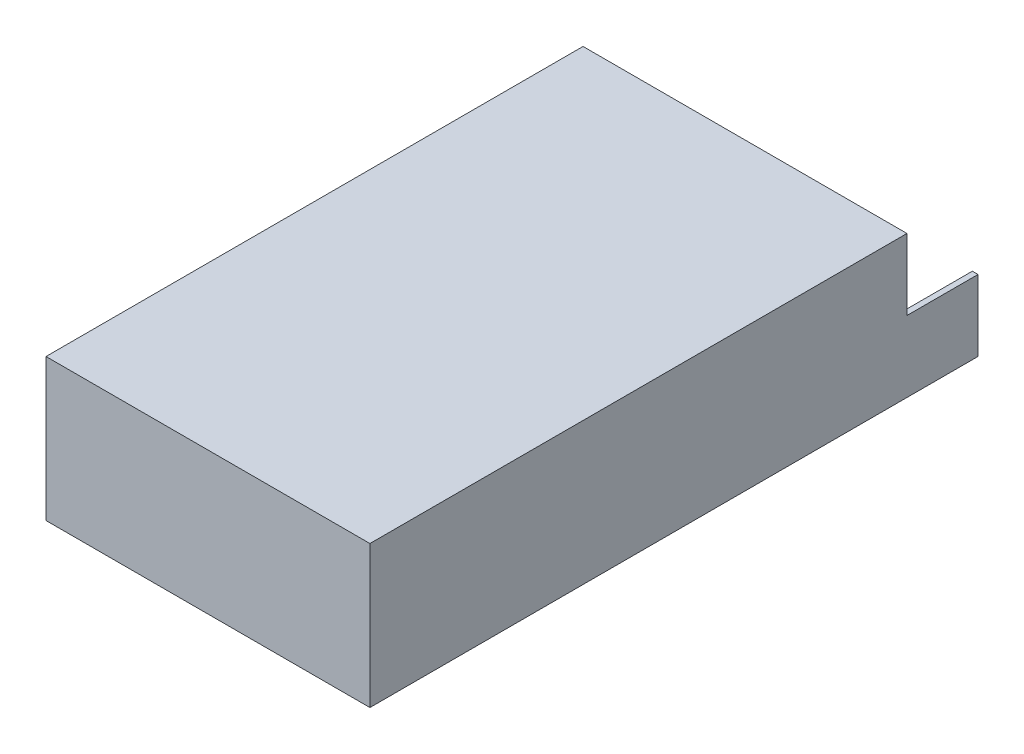
ISO-10303-21;
HEADER;
FILE_DESCRIPTION(('STEP AP214'),'2;1');
FILE_NAME('part.step','',(''),(''),'','','');
FILE_SCHEMA(('AUTOMOTIVE_DESIGN { 1 0 10303 214 1 1 1 1 }'));
ENDSEC;
DATA;
#1=APPLICATION_CONTEXT('core data for automotive mechanical design processes');
#2=APPLICATION_PROTOCOL_DEFINITION('international standard','automotive_design',2000,#1);
#3=PRODUCT_CONTEXT('',#1,'mechanical');
#4=PRODUCT('Part','Part','',(#3));
#5=PRODUCT_RELATED_PRODUCT_CATEGORY('part','',(#4));
#6=PRODUCT_DEFINITION_FORMATION('','',#4);
#7=PRODUCT_DEFINITION_CONTEXT('part definition',#1,'design');
#8=PRODUCT_DEFINITION('design','',#6,#7);
#9=PRODUCT_DEFINITION_SHAPE('','',#8);
#10=(LENGTH_UNIT() NAMED_UNIT(*) SI_UNIT(.MILLI.,.METRE.));
#11=(NAMED_UNIT(*) PLANE_ANGLE_UNIT() SI_UNIT($,.RADIAN.));
#12=(NAMED_UNIT(*) SI_UNIT($,.STERADIAN.) SOLID_ANGLE_UNIT());
#13=UNCERTAINTY_MEASURE_WITH_UNIT(LENGTH_MEASURE(1.E-05),#10,'distance_accuracy_value','');
#14=(GEOMETRIC_REPRESENTATION_CONTEXT(3) GLOBAL_UNCERTAINTY_ASSIGNED_CONTEXT((#13)) GLOBAL_UNIT_ASSIGNED_CONTEXT((#10,
#11,#12)) REPRESENTATION_CONTEXT('',''));
#15=CARTESIAN_POINT('',(0.,0.,0.));
#16=DIRECTION('',(0.,0.,1.));
#17=DIRECTION('',(1.,0.,0.));
#18=AXIS2_PLACEMENT_3D('',#15,#16,#17);
#19=CARTESIAN_POINT('',(0.,25.,-214.));
#20=DIRECTION('',(0.,-1.,0.));
#21=DIRECTION('',(0.,0.,-1.));
#22=AXIS2_PLACEMENT_3D('',#19,#20,#21);
#23=PLANE('',#22);
#24=DIRECTION('',(0.,0.,-1.));
#25=VECTOR('',#24,1.);
#26=CARTESIAN_POINT('',(112.,25.,-214.));
#27=LINE('',#26,#25);
#28=CARTESIAN_POINT('',(112.,25.,-189.));
#29=VERTEX_POINT('',#28);
#30=CARTESIAN_POINT('',(112.,25.,-214.));
#31=VERTEX_POINT('',#30);
#32=EDGE_CURVE('E11',#29,#31,#27,.T.);
#33=ORIENTED_EDGE('',*,*,#32,.F.);
#34=DIRECTION('',(1.,0.,0.));
#35=VECTOR('',#34,1.);
#36=CARTESIAN_POINT('',(0.,25.,-189.));
#37=LINE('',#36,#35);
#38=CARTESIAN_POINT('',(114.,25.,-189.));
#39=VERTEX_POINT('',#38);
#40=EDGE_CURVE('E202',#29,#39,#37,.T.);
#41=ORIENTED_EDGE('',*,*,#40,.T.);
#42=DIRECTION('',(0.,0.,-1.));
#43=VECTOR('',#42,1.);
#44=CARTESIAN_POINT('',(114.,25.,-214.));
#45=LINE('',#44,#43);
#46=CARTESIAN_POINT('',(114.,25.,-214.));
#47=VERTEX_POINT('',#46);
#48=EDGE_CURVE('E184',#39,#47,#45,.T.);
#49=ORIENTED_EDGE('',*,*,#48,.T.);
#50=DIRECTION('',(1.,0.,0.));
#51=VECTOR('',#50,1.);
#52=CARTESIAN_POINT('',(0.,25.,-214.));
#53=LINE('',#52,#51);
#54=EDGE_CURVE('E197',#31,#47,#53,.T.);
#55=ORIENTED_EDGE('',*,*,#54,.F.);
#56=EDGE_LOOP('',(#33,#41,#49,#55));
#57=FACE_BOUND('',#56,.T.);
#58=ADVANCED_FACE('F34',(#57),#23,.F.);
#59=CARTESIAN_POINT('',(0.,50.,1.11022302462516E-13));
#60=DIRECTION('',(1.,0.,0.));
#61=DIRECTION('',(0.,0.,-1.));
#62=AXIS2_PLACEMENT_3D('',#59,#60,#61);
#63=PLANE('',#62);
#64=DIRECTION('',(0.,-1.,0.));
#65=VECTOR('',#64,1.);
#66=CARTESIAN_POINT('',(0.,50.,-189.));
#67=LINE('',#66,#65);
#68=CARTESIAN_POINT('',(0.,50.,-189.));
#69=VERTEX_POINT('',#68);
#70=CARTESIAN_POINT('',(0.,25.,-189.));
#71=VERTEX_POINT('',#70);
#72=EDGE_CURVE('E60',#69,#71,#67,.T.);
#73=ORIENTED_EDGE('',*,*,#72,.T.);
#74=DIRECTION('',(0.,0.,-1.));
#75=VECTOR('',#74,1.);
#76=CARTESIAN_POINT('',(0.,25.,-214.));
#77=LINE('',#76,#75);
#78=CARTESIAN_POINT('',(0.,25.,-214.));
#79=VERTEX_POINT('',#78);
#80=EDGE_CURVE('E183',#71,#79,#77,.T.);
#81=ORIENTED_EDGE('',*,*,#80,.T.);
#82=DIRECTION('',(0.,-1.,0.));
#83=VECTOR('',#82,1.);
#84=CARTESIAN_POINT('',(0.,50.,-214.));
#85=LINE('',#84,#83);
#86=CARTESIAN_POINT('',(0.,0.,-214.));
#87=VERTEX_POINT('',#86);
#88=EDGE_CURVE('E212',#79,#87,#85,.T.);
#89=ORIENTED_EDGE('',*,*,#88,.T.);
#90=DIRECTION('',(0.,0.,1.));
#91=VECTOR('',#90,1.);
#92=CARTESIAN_POINT('',(0.,0.,0.));
#93=LINE('',#92,#91);
#94=CARTESIAN_POINT('',(0.,0.,0.));
#95=VERTEX_POINT('',#94);
#96=EDGE_CURVE('E196',#87,#95,#93,.T.);
#97=ORIENTED_EDGE('',*,*,#96,.T.);
#98=DIRECTION('',(0.,-1.,0.));
#99=VECTOR('',#98,1.);
#100=CARTESIAN_POINT('',(0.,50.,1.11022302462516E-13));
#101=LINE('',#100,#99);
#102=CARTESIAN_POINT('',(0.,50.,1.11022302462516E-13));
#103=VERTEX_POINT('',#102);
#104=EDGE_CURVE('E228',#103,#95,#101,.T.);
#105=ORIENTED_EDGE('',*,*,#104,.F.);
#106=DIRECTION('',(0.,0.,1.));
#107=VECTOR('',#106,1.);
#108=CARTESIAN_POINT('',(0.,50.,1.11022302462516E-13));
#109=LINE('',#108,#107);
#110=EDGE_CURVE('E204',#69,#103,#109,.T.);
#111=ORIENTED_EDGE('',*,*,#110,.F.);
#112=EDGE_LOOP('',(#73,#81,#89,#97,#105,#111));
#113=FACE_BOUND('',#112,.T.);
#114=ADVANCED_FACE('F36',(#113),#63,.F.);
#115=CARTESIAN_POINT('',(0.,50.,1.11022302462516E-13));
#116=DIRECTION('',(0.,0.,-1.));
#117=DIRECTION('',(-1.,0.,0.));
#118=AXIS2_PLACEMENT_3D('',#115,#116,#117);
#119=PLANE('',#118);
#120=DIRECTION('',(1.,0.,0.));
#121=VECTOR('',#120,1.);
#122=CARTESIAN_POINT('',(0.,0.,0.));
#123=LINE('',#122,#121);
#124=CARTESIAN_POINT('',(114.,0.,-3.33066907387547E-13));
#125=VERTEX_POINT('',#124);
#126=EDGE_CURVE('E215',#95,#125,#123,.T.);
#127=ORIENTED_EDGE('',*,*,#126,.T.);
#128=DIRECTION('',(0.,-1.,0.));
#129=VECTOR('',#128,1.);
#130=CARTESIAN_POINT('',(114.,50.,-1.11022302462516E-13));
#131=LINE('',#130,#129);
#132=CARTESIAN_POINT('',(114.,50.,-1.11022302462516E-13));
#133=VERTEX_POINT('',#132);
#134=EDGE_CURVE('E225',#133,#125,#131,.T.);
#135=ORIENTED_EDGE('',*,*,#134,.F.);
#136=DIRECTION('',(1.,0.,0.));
#137=VECTOR('',#136,1.);
#138=CARTESIAN_POINT('',(0.,50.,1.11022302462516E-13));
#139=LINE('',#138,#137);
#140=EDGE_CURVE('E206',#103,#133,#139,.T.);
#141=ORIENTED_EDGE('',*,*,#140,.F.);
#142=ORIENTED_EDGE('',*,*,#104,.T.);
#143=EDGE_LOOP('',(#127,#135,#141,#142));
#144=FACE_BOUND('',#143,.T.);
#145=ADVANCED_FACE('F278',(#144),#119,.F.);
#146=CARTESIAN_POINT('',(114.,50.,-1.11022302462516E-13));
#147=DIRECTION('',(-1.,0.,0.));
#148=DIRECTION('',(0.,0.,1.));
#149=AXIS2_PLACEMENT_3D('',#146,#147,#148);
#150=PLANE('',#149);
#151=DIRECTION('',(0.,-1.,0.));
#152=VECTOR('',#151,1.);
#153=CARTESIAN_POINT('',(114.,50.,-214.));
#154=LINE('',#153,#152);
#155=CARTESIAN_POINT('',(114.,0.,-214.));
#156=VERTEX_POINT('',#155);
#157=EDGE_CURVE('E223',#47,#156,#154,.T.);
#158=ORIENTED_EDGE('',*,*,#157,.F.);
#159=ORIENTED_EDGE('',*,*,#48,.F.);
#160=DIRECTION('',(0.,-1.,0.));
#161=VECTOR('',#160,1.);
#162=CARTESIAN_POINT('',(114.,50.,-189.));
#163=LINE('',#162,#161);
#164=CARTESIAN_POINT('',(114.,50.,-189.));
#165=VERTEX_POINT('',#164);
#166=EDGE_CURVE('E188',#165,#39,#163,.T.);
#167=ORIENTED_EDGE('',*,*,#166,.F.);
#168=DIRECTION('',(0.,0.,-1.));
#169=VECTOR('',#168,1.);
#170=CARTESIAN_POINT('',(114.,50.,-1.11022302462516E-13));
#171=LINE('',#170,#169);
#172=EDGE_CURVE('E209',#133,#165,#171,.T.);
#173=ORIENTED_EDGE('',*,*,#172,.F.);
#174=ORIENTED_EDGE('',*,*,#134,.T.);
#175=DIRECTION('',(0.,0.,-1.));
#176=VECTOR('',#175,1.);
#177=CARTESIAN_POINT('',(114.,0.,-3.33066907387547E-13));
#178=LINE('',#177,#176);
#179=EDGE_CURVE('E217',#125,#156,#178,.T.);
#180=ORIENTED_EDGE('',*,*,#179,.T.);
#181=EDGE_LOOP('',(#158,#159,#167,#173,#174,#180));
#182=FACE_BOUND('',#181,.T.);
#183=ADVANCED_FACE('F284',(#182),#150,.F.);
#184=CARTESIAN_POINT('',(0.,50.,-214.));
#185=DIRECTION('',(0.,0.,1.));
#186=DIRECTION('',(1.,0.,0.));
#187=AXIS2_PLACEMENT_3D('',#184,#185,#186);
#188=PLANE('',#187);
#189=CARTESIAN_POINT('',(2.,25.,-214.));
#190=VERTEX_POINT('',#189);
#191=EDGE_CURVE('E193',#79,#190,#53,.T.);
#192=ORIENTED_EDGE('',*,*,#191,.T.);
#193=DIRECTION('',(0.,-1.,0.));
#194=VECTOR('',#193,1.);
#195=CARTESIAN_POINT('',(2.,50.,-214.));
#196=LINE('',#195,#194);
#197=CARTESIAN_POINT('',(1.99999999999999,1.99999999999997,-214.));
#198=VERTEX_POINT('',#197);
#199=EDGE_CURVE('E52',#190,#198,#196,.T.);
#200=ORIENTED_EDGE('',*,*,#199,.T.);
#201=DIRECTION('',(-1.,0.,0.));
#202=VECTOR('',#201,1.);
#203=CARTESIAN_POINT('',(0.,2.,-214.));
#204=LINE('',#203,#202);
#205=CARTESIAN_POINT('',(112.,2.,-214.));
#206=VERTEX_POINT('',#205);
#207=EDGE_CURVE('E155',#206,#198,#204,.T.);
#208=ORIENTED_EDGE('',*,*,#207,.F.);
#209=DIRECTION('',(0.,-1.,0.));
#210=VECTOR('',#209,1.);
#211=CARTESIAN_POINT('',(112.,50.,-214.));
#212=LINE('',#211,#210);
#213=EDGE_CURVE('E170',#31,#206,#212,.T.);
#214=ORIENTED_EDGE('',*,*,#213,.F.);
#215=ORIENTED_EDGE('',*,*,#54,.T.);
#216=ORIENTED_EDGE('',*,*,#157,.T.);
#217=DIRECTION('',(-1.,0.,0.));
#218=VECTOR('',#217,1.);
#219=CARTESIAN_POINT('',(0.,0.,-214.));
#220=LINE('',#219,#218);
#221=EDGE_CURVE('E207',#156,#87,#220,.T.);
#222=ORIENTED_EDGE('',*,*,#221,.T.);
#223=ORIENTED_EDGE('',*,*,#88,.F.);
#224=EDGE_LOOP('',(#192,#200,#208,#214,#215,#216,#222,#223));
#225=FACE_BOUND('',#224,.T.);
#226=ADVANCED_FACE('F264',(#225),#188,.F.);
#227=CARTESIAN_POINT('',(0.,50.,1.11022302462516E-13));
#228=DIRECTION('',(0.,-1.,0.));
#229=DIRECTION('',(0.,0.,-1.));
#230=AXIS2_PLACEMENT_3D('',#227,#228,#229);
#231=PLANE('',#230);
#232=ORIENTED_EDGE('',*,*,#172,.T.);
#233=DIRECTION('',(1.,0.,0.));
#234=VECTOR('',#233,1.);
#235=CARTESIAN_POINT('',(0.,50.,-189.));
#236=LINE('',#235,#234);
#237=EDGE_CURVE('E187',#69,#165,#236,.T.);
#238=ORIENTED_EDGE('',*,*,#237,.F.);
#239=ORIENTED_EDGE('',*,*,#110,.T.);
#240=ORIENTED_EDGE('',*,*,#140,.T.);
#241=EDGE_LOOP('',(#232,#238,#239,#240));
#242=FACE_BOUND('',#241,.T.);
#243=ADVANCED_FACE('F275',(#242),#231,.F.);
#244=CARTESIAN_POINT('',(0.,0.,0.));
#245=DIRECTION('',(0.,-1.,0.));
#246=DIRECTION('',(0.,0.,-1.));
#247=AXIS2_PLACEMENT_3D('',#244,#245,#246);
#248=PLANE('',#247);
#249=CARTESIAN_POINT('',(57.0000000000001,0.,-107.));
#250=DIRECTION('',(0.,-1.,0.));
#251=DIRECTION('',(0.,0.,-1.));
#252=AXIS2_PLACEMENT_3D('',#249,#250,#251);
#253=CIRCLE('',#252,2.14999999999999);
#254=CARTESIAN_POINT('',(57.0000000000001,0.,-109.15));
#255=VERTEX_POINT('',#254);
#256=EDGE_CURVE('E253',#255,#255,#253,.T.);
#257=ORIENTED_EDGE('',*,*,#256,.F.);
#258=EDGE_LOOP('',(#257));
#259=FACE_BOUND('',#258,.T.);
#260=CARTESIAN_POINT('',(32.0000000000001,0.,-182.));
#261=DIRECTION('',(0.,-1.,0.));
#262=DIRECTION('',(0.,0.,-1.));
#263=AXIS2_PLACEMENT_3D('',#260,#261,#262);
#264=CIRCLE('',#263,2.14999999999999);
#265=CARTESIAN_POINT('',(32.0000000000001,0.,-184.15));
#266=VERTEX_POINT('',#265);
#267=EDGE_CURVE('E243',#266,#266,#264,.T.);
#268=ORIENTED_EDGE('',*,*,#267,.F.);
#269=EDGE_LOOP('',(#268));
#270=FACE_BOUND('',#269,.T.);
#271=CARTESIAN_POINT('',(82.0000000000001,0.,-32.));
#272=DIRECTION('',(0.,-1.,0.));
#273=DIRECTION('',(0.,0.,-1.));
#274=AXIS2_PLACEMENT_3D('',#271,#272,#273);
#275=CIRCLE('',#274,2.14999999999999);
#276=CARTESIAN_POINT('',(82.0000000000001,0.,-34.15));
#277=VERTEX_POINT('',#276);
#278=EDGE_CURVE('E240',#277,#277,#275,.T.);
#279=ORIENTED_EDGE('',*,*,#278,.F.);
#280=EDGE_LOOP('',(#279));
#281=FACE_BOUND('',#280,.T.);
#282=CARTESIAN_POINT('',(82.0000000000001,0.,-182.));
#283=DIRECTION('',(0.,-1.,0.));
#284=DIRECTION('',(0.,0.,-1.));
#285=AXIS2_PLACEMENT_3D('',#282,#283,#284);
#286=CIRCLE('',#285,2.14999999999999);
#287=CARTESIAN_POINT('',(82.0000000000001,0.,-184.15));
#288=VERTEX_POINT('',#287);
#289=EDGE_CURVE('E237',#288,#288,#286,.T.);
#290=ORIENTED_EDGE('',*,*,#289,.F.);
#291=EDGE_LOOP('',(#290));
#292=FACE_BOUND('',#291,.T.);
#293=CARTESIAN_POINT('',(32.0000000000001,0.,-31.9999999999999));
#294=DIRECTION('',(0.,-1.,0.));
#295=DIRECTION('',(0.,0.,-1.));
#296=AXIS2_PLACEMENT_3D('',#293,#294,#295);
#297=CIRCLE('',#296,2.14999999999999);
#298=CARTESIAN_POINT('',(32.0000000000001,0.,-34.1499999999999));
#299=VERTEX_POINT('',#298);
#300=EDGE_CURVE('E233',#299,#299,#297,.T.);
#301=ORIENTED_EDGE('',*,*,#300,.F.);
#302=EDGE_LOOP('',(#301));
#303=FACE_BOUND('',#302,.T.);
#304=ORIENTED_EDGE('',*,*,#96,.F.);
#305=ORIENTED_EDGE('',*,*,#221,.F.);
#306=ORIENTED_EDGE('',*,*,#179,.F.);
#307=ORIENTED_EDGE('',*,*,#126,.F.);
#308=EDGE_LOOP('',(#304,#305,#306,#307));
#309=FACE_BOUND('',#308,.T.);
#310=ADVANCED_FACE('F317',(#259,#270,#281,#292,#303,#309),#248,.T.);
#311=CARTESIAN_POINT('',(2.00000000000002,25.,-189.));
#312=VERTEX_POINT('',#311);
#313=EDGE_CURVE('E198',#71,#312,#37,.T.);
#314=ORIENTED_EDGE('',*,*,#313,.T.);
#315=DIRECTION('',(0.,0.,-1.));
#316=VECTOR('',#315,1.);
#317=CARTESIAN_POINT('',(2.,25.,-1.11022302462516E-13));
#318=LINE('',#317,#316);
#319=EDGE_CURVE('E43',#312,#190,#318,.T.);
#320=ORIENTED_EDGE('',*,*,#319,.T.);
#321=ORIENTED_EDGE('',*,*,#191,.F.);
#322=ORIENTED_EDGE('',*,*,#80,.F.);
#323=EDGE_LOOP('',(#314,#320,#321,#322));
#324=FACE_BOUND('',#323,.T.);
#325=ADVANCED_FACE('F269',(#324),#23,.F.);
#326=CARTESIAN_POINT('',(0.,50.,-189.));
#327=DIRECTION('',(0.,0.,1.));
#328=DIRECTION('',(1.,0.,0.));
#329=AXIS2_PLACEMENT_3D('',#326,#327,#328);
#330=PLANE('',#329);
#331=ORIENTED_EDGE('',*,*,#166,.T.);
#332=ORIENTED_EDGE('',*,*,#40,.F.);
#333=EDGE_CURVE('E201',#312,#29,#37,.T.);
#334=ORIENTED_EDGE('',*,*,#333,.F.);
#335=ORIENTED_EDGE('',*,*,#313,.F.);
#336=ORIENTED_EDGE('',*,*,#72,.F.);
#337=ORIENTED_EDGE('',*,*,#237,.T.);
#338=EDGE_LOOP('',(#331,#332,#334,#335,#336,#337));
#339=FACE_BOUND('',#338,.T.);
#340=ADVANCED_FACE('F287',(#339),#330,.F.);
#341=CARTESIAN_POINT('',(0.,25.,-214.));
#342=DIRECTION('',(0.,-1.,0.));
#343=DIRECTION('',(0.,0.,-1.));
#344=AXIS2_PLACEMENT_3D('',#341,#342,#343);
#345=PLANE('',#344);
#346=ORIENTED_EDGE('',*,*,#333,.T.);
#347=CARTESIAN_POINT('',(112.,25.,-187.));
#348=VERTEX_POINT('',#347);
#349=EDGE_CURVE('E45',#348,#29,#27,.T.);
#350=ORIENTED_EDGE('',*,*,#349,.F.);
#351=DIRECTION('',(1.,0.,0.));
#352=VECTOR('',#351,1.);
#353=CARTESIAN_POINT('',(0.,25.,-187.));
#354=LINE('',#353,#352);
#355=CARTESIAN_POINT('',(2.,25.,-187.));
#356=VERTEX_POINT('',#355);
#357=EDGE_CURVE('E150',#356,#348,#354,.T.);
#358=ORIENTED_EDGE('',*,*,#357,.F.);
#359=EDGE_CURVE('E139',#356,#312,#318,.T.);
#360=ORIENTED_EDGE('',*,*,#359,.T.);
#361=EDGE_LOOP('',(#346,#350,#358,#360));
#362=FACE_BOUND('',#361,.T.);
#363=ADVANCED_FACE('F293',(#362),#345,.T.);
#364=CARTESIAN_POINT('',(2.,50.,-1.11022302462516E-13));
#365=DIRECTION('',(1.,0.,0.));
#366=DIRECTION('',(0.,0.,-1.));
#367=AXIS2_PLACEMENT_3D('',#364,#365,#366);
#368=PLANE('',#367);
#369=DIRECTION('',(0.,-1.,0.));
#370=VECTOR('',#369,1.);
#371=CARTESIAN_POINT('',(2.,50.,-187.));
#372=LINE('',#371,#370);
#373=CARTESIAN_POINT('',(1.99999999999999,48.,-187.));
#374=VERTEX_POINT('',#373);
#375=EDGE_CURVE('E131',#374,#356,#372,.T.);
#376=ORIENTED_EDGE('',*,*,#375,.F.);
#377=DIRECTION('',(0.,0.,1.));
#378=VECTOR('',#377,1.);
#379=CARTESIAN_POINT('',(1.99999999999999,48.,-1.11022302462516E-13));
#380=LINE('',#379,#378);
#381=CARTESIAN_POINT('',(2.,48.,-2.00000000000011));
#382=VERTEX_POINT('',#381);
#383=EDGE_CURVE('E136',#374,#382,#380,.T.);
#384=ORIENTED_EDGE('',*,*,#383,.T.);
#385=DIRECTION('',(0.,-1.,0.));
#386=VECTOR('',#385,1.);
#387=CARTESIAN_POINT('',(2.00000000000002,50.,-2.00000000000011));
#388=LINE('',#387,#386);
#389=CARTESIAN_POINT('',(2.,2.,-2.));
#390=VERTEX_POINT('',#389);
#391=EDGE_CURVE('E163',#382,#390,#388,.T.);
#392=ORIENTED_EDGE('',*,*,#391,.T.);
#393=DIRECTION('',(0.,0.,1.));
#394=VECTOR('',#393,1.);
#395=CARTESIAN_POINT('',(2.,2.,-2.22044604925031E-13));
#396=LINE('',#395,#394);
#397=EDGE_CURVE('E167',#198,#390,#396,.T.);
#398=ORIENTED_EDGE('',*,*,#397,.F.);
#399=ORIENTED_EDGE('',*,*,#199,.F.);
#400=ORIENTED_EDGE('',*,*,#319,.F.);
#401=ORIENTED_EDGE('',*,*,#359,.F.);
#402=EDGE_LOOP('',(#376,#384,#392,#398,#399,#400,#401));
#403=FACE_BOUND('',#402,.T.);
#404=ADVANCED_FACE('F133',(#403),#368,.T.);
#405=CARTESIAN_POINT('',(0.,50.,-1.99999999999989));
#406=DIRECTION('',(0.,0.,-1.));
#407=DIRECTION('',(-1.,0.,0.));
#408=AXIS2_PLACEMENT_3D('',#405,#406,#407);
#409=PLANE('',#408);
#410=DIRECTION('',(1.,0.,0.));
#411=VECTOR('',#410,1.);
#412=CARTESIAN_POINT('',(0.,2.,-1.99999999999978));
#413=LINE('',#412,#411);
#414=CARTESIAN_POINT('',(112.,1.99999999999997,-2.));
#415=VERTEX_POINT('',#414);
#416=EDGE_CURVE('E165',#390,#415,#413,.T.);
#417=ORIENTED_EDGE('',*,*,#416,.F.);
#418=ORIENTED_EDGE('',*,*,#391,.F.);
#419=DIRECTION('',(1.,0.,0.));
#420=VECTOR('',#419,1.);
#421=CARTESIAN_POINT('',(0.,48.,-1.99999999999989));
#422=LINE('',#421,#420);
#423=CARTESIAN_POINT('',(112.,48.,-1.99999999999989));
#424=VERTEX_POINT('',#423);
#425=EDGE_CURVE('E153',#382,#424,#422,.T.);
#426=ORIENTED_EDGE('',*,*,#425,.T.);
#427=DIRECTION('',(0.,-1.,0.));
#428=VECTOR('',#427,1.);
#429=CARTESIAN_POINT('',(112.,50.,-1.99999999999989));
#430=LINE('',#429,#428);
#431=EDGE_CURVE('E168',#424,#415,#430,.T.);
#432=ORIENTED_EDGE('',*,*,#431,.T.);
#433=EDGE_LOOP('',(#417,#418,#426,#432));
#434=FACE_BOUND('',#433,.T.);
#435=ADVANCED_FACE('F300',(#434),#409,.T.);
#436=CARTESIAN_POINT('',(112.,50.,1.11022302462516E-13));
#437=DIRECTION('',(-1.,0.,0.));
#438=DIRECTION('',(0.,0.,1.));
#439=AXIS2_PLACEMENT_3D('',#436,#437,#438);
#440=PLANE('',#439);
#441=ORIENTED_EDGE('',*,*,#213,.T.);
#442=DIRECTION('',(0.,0.,-1.));
#443=VECTOR('',#442,1.);
#444=CARTESIAN_POINT('',(112.,1.99999999999997,0.));
#445=LINE('',#444,#443);
#446=EDGE_CURVE('E159',#415,#206,#445,.T.);
#447=ORIENTED_EDGE('',*,*,#446,.F.);
#448=ORIENTED_EDGE('',*,*,#431,.F.);
#449=DIRECTION('',(0.,0.,-1.));
#450=VECTOR('',#449,1.);
#451=CARTESIAN_POINT('',(112.,48.,1.11022302462516E-13));
#452=LINE('',#451,#450);
#453=CARTESIAN_POINT('',(112.,48.,-187.));
#454=VERTEX_POINT('',#453);
#455=EDGE_CURVE('E157',#424,#454,#452,.T.);
#456=ORIENTED_EDGE('',*,*,#455,.T.);
#457=DIRECTION('',(0.,-1.,0.));
#458=VECTOR('',#457,1.);
#459=CARTESIAN_POINT('',(112.,50.,-187.));
#460=LINE('',#459,#458);
#461=EDGE_CURVE('E146',#454,#348,#460,.T.);
#462=ORIENTED_EDGE('',*,*,#461,.T.);
#463=ORIENTED_EDGE('',*,*,#349,.T.);
#464=ORIENTED_EDGE('',*,*,#32,.T.);
#465=EDGE_LOOP('',(#441,#447,#448,#456,#462,#463,#464));
#466=FACE_BOUND('',#465,.T.);
#467=ADVANCED_FACE('F295',(#466),#440,.T.);
#468=CARTESIAN_POINT('',(0.,48.,1.11022302462516E-13));
#469=DIRECTION('',(0.,-1.,0.));
#470=DIRECTION('',(0.,0.,-1.));
#471=AXIS2_PLACEMENT_3D('',#468,#469,#470);
#472=PLANE('',#471);
#473=ORIENTED_EDGE('',*,*,#455,.F.);
#474=ORIENTED_EDGE('',*,*,#425,.F.);
#475=ORIENTED_EDGE('',*,*,#383,.F.);
#476=DIRECTION('',(1.,0.,0.));
#477=VECTOR('',#476,1.);
#478=CARTESIAN_POINT('',(0.,48.,-187.));
#479=LINE('',#478,#477);
#480=EDGE_CURVE('E143',#374,#454,#479,.T.);
#481=ORIENTED_EDGE('',*,*,#480,.T.);
#482=EDGE_LOOP('',(#473,#474,#475,#481));
#483=FACE_BOUND('',#482,.T.);
#484=ADVANCED_FACE('F152',(#483),#472,.T.);
#485=CARTESIAN_POINT('',(0.,2.,0.));
#486=DIRECTION('',(0.,-1.,0.));
#487=DIRECTION('',(0.,0.,-1.));
#488=AXIS2_PLACEMENT_3D('',#485,#486,#487);
#489=PLANE('',#488);
#490=CARTESIAN_POINT('',(57.0000000000001,1.99999999999995,-107.));
#491=DIRECTION('',(0.,-1.,0.));
#492=DIRECTION('',(0.,0.,-1.));
#493=AXIS2_PLACEMENT_3D('',#490,#491,#492);
#494=CIRCLE('',#493,2.15);
#495=CARTESIAN_POINT('',(57.0000000000001,1.99999999999995,-109.15));
#496=VERTEX_POINT('',#495);
#497=EDGE_CURVE('E38',#496,#496,#494,.T.);
#498=ORIENTED_EDGE('',*,*,#497,.T.);
#499=EDGE_LOOP('',(#498));
#500=FACE_BOUND('',#499,.T.);
#501=CARTESIAN_POINT('',(32.0000000000001,2.,-182.));
#502=DIRECTION('',(0.,-1.,0.));
#503=DIRECTION('',(0.,0.,-1.));
#504=AXIS2_PLACEMENT_3D('',#501,#502,#503);
#505=CIRCLE('',#504,2.15);
#506=CARTESIAN_POINT('',(32.0000000000001,2.,-184.15));
#507=VERTEX_POINT('',#506);
#508=EDGE_CURVE('E241',#507,#507,#505,.T.);
#509=ORIENTED_EDGE('',*,*,#508,.T.);
#510=EDGE_LOOP('',(#509));
#511=FACE_BOUND('',#510,.T.);
#512=CARTESIAN_POINT('',(82.0000000000001,2.,-32.));
#513=DIRECTION('',(0.,-1.,0.));
#514=DIRECTION('',(0.,0.,-1.));
#515=AXIS2_PLACEMENT_3D('',#512,#513,#514);
#516=CIRCLE('',#515,2.14999999999999);
#517=CARTESIAN_POINT('',(82.0000000000001,2.,-34.15));
#518=VERTEX_POINT('',#517);
#519=EDGE_CURVE('E238',#518,#518,#516,.T.);
#520=ORIENTED_EDGE('',*,*,#519,.T.);
#521=EDGE_LOOP('',(#520));
#522=FACE_BOUND('',#521,.T.);
#523=CARTESIAN_POINT('',(82.0000000000001,1.99999999999995,-182.));
#524=DIRECTION('',(0.,-1.,0.));
#525=DIRECTION('',(0.,0.,-1.));
#526=AXIS2_PLACEMENT_3D('',#523,#524,#525);
#527=CIRCLE('',#526,2.14999999999999);
#528=CARTESIAN_POINT('',(82.0000000000001,1.99999999999995,-184.15));
#529=VERTEX_POINT('',#528);
#530=EDGE_CURVE('E234',#529,#529,#527,.T.);
#531=ORIENTED_EDGE('',*,*,#530,.T.);
#532=EDGE_LOOP('',(#531));
#533=FACE_BOUND('',#532,.T.);
#534=CARTESIAN_POINT('',(32.0000000000001,2.,-31.9999999999999));
#535=DIRECTION('',(0.,-1.,0.));
#536=DIRECTION('',(0.,0.,-1.));
#537=AXIS2_PLACEMENT_3D('',#534,#535,#536);
#538=CIRCLE('',#537,2.15);
#539=CARTESIAN_POINT('',(32.0000000000001,2.,-34.1499999999999));
#540=VERTEX_POINT('',#539);
#541=EDGE_CURVE('E173',#540,#540,#538,.T.);
#542=ORIENTED_EDGE('',*,*,#541,.T.);
#543=EDGE_LOOP('',(#542));
#544=FACE_BOUND('',#543,.T.);
#545=ORIENTED_EDGE('',*,*,#397,.T.);
#546=ORIENTED_EDGE('',*,*,#416,.T.);
#547=ORIENTED_EDGE('',*,*,#446,.T.);
#548=ORIENTED_EDGE('',*,*,#207,.T.);
#549=EDGE_LOOP('',(#545,#546,#547,#548));
#550=FACE_BOUND('',#549,.T.);
#551=ADVANCED_FACE('F261',(#500,#511,#522,#533,#544,#550),#489,.F.);
#552=CARTESIAN_POINT('',(0.,50.,-187.));
#553=DIRECTION('',(0.,0.,1.));
#554=DIRECTION('',(1.,0.,0.));
#555=AXIS2_PLACEMENT_3D('',#552,#553,#554);
#556=PLANE('',#555);
#557=ORIENTED_EDGE('',*,*,#461,.F.);
#558=ORIENTED_EDGE('',*,*,#480,.F.);
#559=ORIENTED_EDGE('',*,*,#375,.T.);
#560=ORIENTED_EDGE('',*,*,#357,.T.);
#561=EDGE_LOOP('',(#557,#558,#559,#560));
#562=FACE_BOUND('',#561,.T.);
#563=ADVANCED_FACE('F144',(#562),#556,.T.);
#564=CARTESIAN_POINT('',(32.0000000000001,0.,-31.9999999999999));
#565=DIRECTION('',(0.,-1.,0.));
#566=DIRECTION('',(0.,0.,-1.));
#567=AXIS2_PLACEMENT_3D('',#564,#565,#566);
#568=CYLINDRICAL_SURFACE('',#567,2.15);
#569=ORIENTED_EDGE('',*,*,#300,.T.);
#570=EDGE_LOOP('',(#569));
#571=FACE_BOUND('',#570,.T.);
#572=ORIENTED_EDGE('',*,*,#541,.F.);
#573=EDGE_LOOP('',(#572));
#574=FACE_BOUND('',#573,.T.);
#575=ADVANCED_FACE('F416',(#571,#574),#568,.F.);
#576=CARTESIAN_POINT('',(82.0000000000001,0.,-182.));
#577=DIRECTION('',(0.,-1.,0.));
#578=DIRECTION('',(0.,0.,-1.));
#579=AXIS2_PLACEMENT_3D('',#576,#577,#578);
#580=CYLINDRICAL_SURFACE('',#579,2.14999999999999);
#581=ORIENTED_EDGE('',*,*,#289,.T.);
#582=EDGE_LOOP('',(#581));
#583=FACE_BOUND('',#582,.T.);
#584=ORIENTED_EDGE('',*,*,#530,.F.);
#585=EDGE_LOOP('',(#584));
#586=FACE_BOUND('',#585,.T.);
#587=ADVANCED_FACE('F424',(#583,#586),#580,.F.);
#588=CARTESIAN_POINT('',(82.0000000000001,0.,-32.));
#589=DIRECTION('',(0.,-1.,0.));
#590=DIRECTION('',(0.,0.,-1.));
#591=AXIS2_PLACEMENT_3D('',#588,#589,#590);
#592=CYLINDRICAL_SURFACE('',#591,2.14999999999999);
#593=ORIENTED_EDGE('',*,*,#278,.T.);
#594=EDGE_LOOP('',(#593));
#595=FACE_BOUND('',#594,.T.);
#596=ORIENTED_EDGE('',*,*,#519,.F.);
#597=EDGE_LOOP('',(#596));
#598=FACE_BOUND('',#597,.T.);
#599=ADVANCED_FACE('F434',(#595,#598),#592,.F.);
#600=CARTESIAN_POINT('',(32.0000000000001,0.,-182.));
#601=DIRECTION('',(0.,-1.,0.));
#602=DIRECTION('',(0.,0.,-1.));
#603=AXIS2_PLACEMENT_3D('',#600,#601,#602);
#604=CYLINDRICAL_SURFACE('',#603,2.15);
#605=ORIENTED_EDGE('',*,*,#267,.T.);
#606=EDGE_LOOP('',(#605));
#607=FACE_BOUND('',#606,.T.);
#608=ORIENTED_EDGE('',*,*,#508,.F.);
#609=EDGE_LOOP('',(#608));
#610=FACE_BOUND('',#609,.T.);
#611=ADVANCED_FACE('F444',(#607,#610),#604,.F.);
#612=CARTESIAN_POINT('',(57.0000000000001,0.,-107.));
#613=DIRECTION('',(0.,-1.,0.));
#614=DIRECTION('',(0.,0.,-1.));
#615=AXIS2_PLACEMENT_3D('',#612,#613,#614);
#616=CYLINDRICAL_SURFACE('',#615,2.15);
#617=ORIENTED_EDGE('',*,*,#256,.T.);
#618=EDGE_LOOP('',(#617));
#619=FACE_BOUND('',#618,.T.);
#620=ORIENTED_EDGE('',*,*,#497,.F.);
#621=EDGE_LOOP('',(#620));
#622=FACE_BOUND('',#621,.T.);
#623=ADVANCED_FACE('F454',(#619,#622),#616,.F.);
#624=CLOSED_SHELL('',(#58,#114,#145,#183,#226,#243,#310,#325,#340,#363,#404,#435,#467,#484,#551,
#563,#575,#587,#599,#611,#623));
#625=MANIFOLD_SOLID_BREP('B2',#624);
#626=ADVANCED_BREP_SHAPE_REPRESENTATION('',(#18,#625),#14);
#627=SHAPE_DEFINITION_REPRESENTATION(#9,#626);
ENDSEC;
END-ISO-10303-21;
